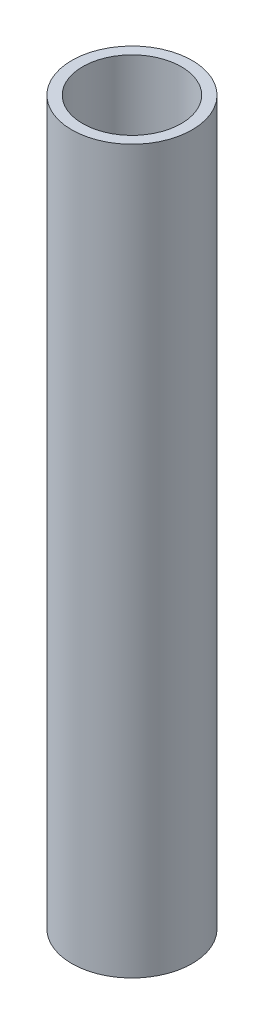
ISO-10303-21;
HEADER;
FILE_DESCRIPTION(('STEP AP214'),'2;1');
FILE_NAME('part.step','',(''),(''),'','','');
FILE_SCHEMA(('AUTOMOTIVE_DESIGN { 1 0 10303 214 1 1 1 1 }'));
ENDSEC;
DATA;
#1=APPLICATION_CONTEXT('core data for automotive mechanical design processes');
#2=APPLICATION_PROTOCOL_DEFINITION('international standard','automotive_design',2000,#1);
#3=PRODUCT_CONTEXT('',#1,'mechanical');
#4=PRODUCT('Part','Part','',(#3));
#5=PRODUCT_RELATED_PRODUCT_CATEGORY('part','',(#4));
#6=PRODUCT_DEFINITION_FORMATION('','',#4);
#7=PRODUCT_DEFINITION_CONTEXT('part definition',#1,'design');
#8=PRODUCT_DEFINITION('design','',#6,#7);
#9=PRODUCT_DEFINITION_SHAPE('','',#8);
#10=(LENGTH_UNIT() NAMED_UNIT(*) SI_UNIT(.MILLI.,.METRE.));
#11=(NAMED_UNIT(*) PLANE_ANGLE_UNIT() SI_UNIT($,.RADIAN.));
#12=(NAMED_UNIT(*) SI_UNIT($,.STERADIAN.) SOLID_ANGLE_UNIT());
#13=UNCERTAINTY_MEASURE_WITH_UNIT(LENGTH_MEASURE(1.E-05),#10,'distance_accuracy_value','');
#14=(GEOMETRIC_REPRESENTATION_CONTEXT(3) GLOBAL_UNCERTAINTY_ASSIGNED_CONTEXT((#13)) GLOBAL_UNIT_ASSIGNED_CONTEXT((#10,
#11,#12)) REPRESENTATION_CONTEXT('',''));
#15=CARTESIAN_POINT('',(0.,0.,0.));
#16=DIRECTION('',(0.,0.,1.));
#17=DIRECTION('',(1.,0.,0.));
#18=AXIS2_PLACEMENT_3D('',#15,#16,#17);
#19=CARTESIAN_POINT('',(0.,152.4,0.));
#20=DIRECTION('',(0.,1.,0.));
#21=DIRECTION('',(0.,0.,1.));
#22=AXIS2_PLACEMENT_3D('',#19,#20,#21);
#23=PLANE('',#22);
#24=CARTESIAN_POINT('',(0.,152.4,0.));
#25=DIRECTION('',(0.,1.,0.));
#26=DIRECTION('',(0.,0.,1.));
#27=AXIS2_PLACEMENT_3D('',#24,#25,#26);
#28=CIRCLE('',#27,12.7);
#29=CARTESIAN_POINT('',(0.,152.4,12.7));
#30=VERTEX_POINT('',#29);
#31=EDGE_CURVE('E10',#30,#30,#28,.T.);
#32=ORIENTED_EDGE('',*,*,#31,.T.);
#33=EDGE_LOOP('',(#32));
#34=FACE_BOUND('',#33,.T.);
#35=CARTESIAN_POINT('',(0.,152.4,0.));
#36=DIRECTION('',(0.,1.,0.));
#37=DIRECTION('',(0.,0.,1.));
#38=AXIS2_PLACEMENT_3D('',#35,#36,#37);
#39=CIRCLE('',#38,10.414);
#40=CARTESIAN_POINT('',(0.,152.4,10.414));
#41=VERTEX_POINT('',#40);
#42=EDGE_CURVE('E42',#41,#41,#39,.T.);
#43=ORIENTED_EDGE('',*,*,#42,.F.);
#44=EDGE_LOOP('',(#43));
#45=FACE_BOUND('',#44,.T.);
#46=ADVANCED_FACE('F31',(#34,#45),#23,.T.);
#47=CARTESIAN_POINT('',(0.,0.,0.));
#48=DIRECTION('',(0.,1.,0.));
#49=DIRECTION('',(0.,0.,1.));
#50=AXIS2_PLACEMENT_3D('',#47,#48,#49);
#51=PLANE('',#50);
#52=CARTESIAN_POINT('',(0.,0.,0.));
#53=DIRECTION('',(0.,1.,0.));
#54=DIRECTION('',(0.,0.,1.));
#55=AXIS2_PLACEMENT_3D('',#52,#53,#54);
#56=CIRCLE('',#55,12.7);
#57=CARTESIAN_POINT('',(0.,0.,12.7));
#58=VERTEX_POINT('',#57);
#59=EDGE_CURVE('E35',#58,#58,#56,.T.);
#60=ORIENTED_EDGE('',*,*,#59,.F.);
#61=EDGE_LOOP('',(#60));
#62=FACE_BOUND('',#61,.T.);
#63=CARTESIAN_POINT('',(0.,0.,0.));
#64=DIRECTION('',(0.,1.,0.));
#65=DIRECTION('',(0.,0.,1.));
#66=AXIS2_PLACEMENT_3D('',#63,#64,#65);
#67=CIRCLE('',#66,10.414);
#68=CARTESIAN_POINT('',(0.,0.,10.414));
#69=VERTEX_POINT('',#68);
#70=EDGE_CURVE('E44',#69,#69,#67,.T.);
#71=ORIENTED_EDGE('',*,*,#70,.T.);
#72=EDGE_LOOP('',(#71));
#73=FACE_BOUND('',#72,.T.);
#74=ADVANCED_FACE('F54',(#62,#73),#51,.F.);
#75=CARTESIAN_POINT('',(0.,152.4,0.));
#76=DIRECTION('',(0.,-1.,0.));
#77=DIRECTION('',(0.,0.,-1.));
#78=AXIS2_PLACEMENT_3D('',#75,#76,#77);
#79=CYLINDRICAL_SURFACE('',#78,12.7);
#80=ORIENTED_EDGE('',*,*,#31,.F.);
#81=EDGE_LOOP('',(#80));
#82=FACE_BOUND('',#81,.T.);
#83=ORIENTED_EDGE('',*,*,#59,.T.);
#84=EDGE_LOOP('',(#83));
#85=FACE_BOUND('',#84,.T.);
#86=ADVANCED_FACE('F33',(#82,#85),#79,.T.);
#87=CARTESIAN_POINT('',(0.,152.4,0.));
#88=DIRECTION('',(0.,-1.,0.));
#89=DIRECTION('',(0.,0.,-1.));
#90=AXIS2_PLACEMENT_3D('',#87,#88,#89);
#91=CYLINDRICAL_SURFACE('',#90,10.414);
#92=ORIENTED_EDGE('',*,*,#42,.T.);
#93=EDGE_LOOP('',(#92));
#94=FACE_BOUND('',#93,.T.);
#95=ORIENTED_EDGE('',*,*,#70,.F.);
#96=EDGE_LOOP('',(#95));
#97=FACE_BOUND('',#96,.T.);
#98=ADVANCED_FACE('F50',(#94,#97),#91,.F.);
#99=CLOSED_SHELL('',(#46,#74,#86,#98));
#100=MANIFOLD_SOLID_BREP('B2',#99);
#101=ADVANCED_BREP_SHAPE_REPRESENTATION('',(#18,#100),#14);
#102=SHAPE_DEFINITION_REPRESENTATION(#9,#101);
ENDSEC;
END-ISO-10303-21;
